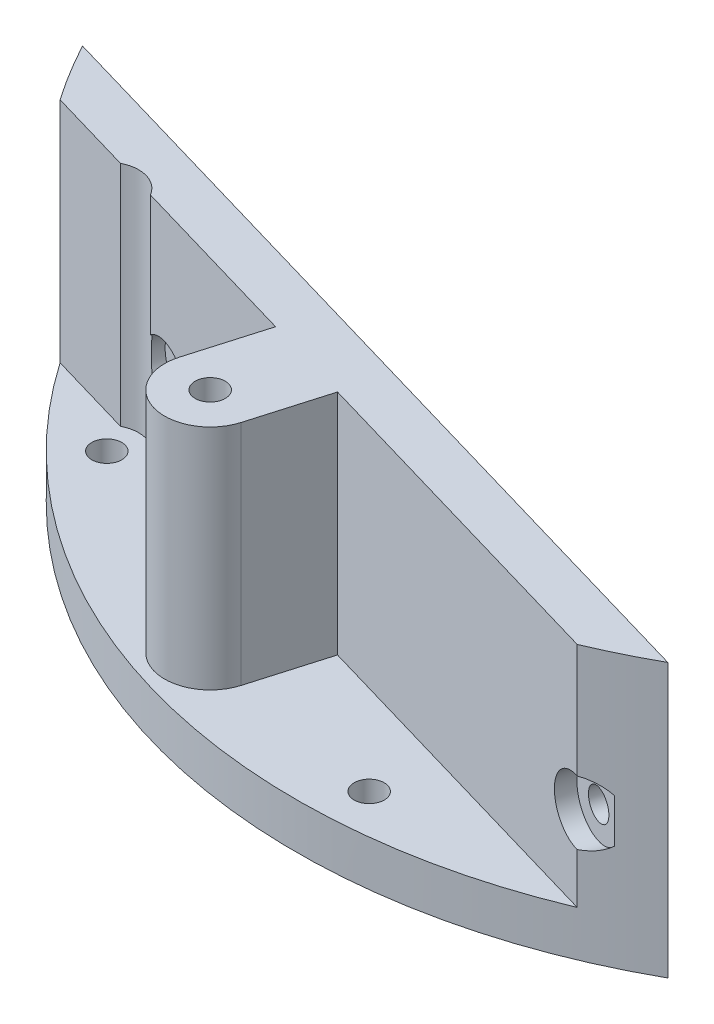
ISO-10303-21;
HEADER;
FILE_DESCRIPTION(('STEP AP214'),'2;1');
FILE_NAME('part.step','',(''),(''),'','','');
FILE_SCHEMA(('AUTOMOTIVE_DESIGN { 1 0 10303 214 1 1 1 1 }'));
ENDSEC;
DATA;
#1=APPLICATION_CONTEXT('core data for automotive mechanical design processes');
#2=APPLICATION_PROTOCOL_DEFINITION('international standard','automotive_design',2000,#1);
#3=PRODUCT_CONTEXT('',#1,'mechanical');
#4=PRODUCT('Part','Part','',(#3));
#5=PRODUCT_RELATED_PRODUCT_CATEGORY('part','',(#4));
#6=PRODUCT_DEFINITION_FORMATION('','',#4);
#7=PRODUCT_DEFINITION_CONTEXT('part definition',#1,'design');
#8=PRODUCT_DEFINITION('design','',#6,#7);
#9=PRODUCT_DEFINITION_SHAPE('','',#8);
#10=(LENGTH_UNIT() NAMED_UNIT(*) SI_UNIT(.MILLI.,.METRE.));
#11=(NAMED_UNIT(*) PLANE_ANGLE_UNIT() SI_UNIT($,.RADIAN.));
#12=(NAMED_UNIT(*) SI_UNIT($,.STERADIAN.) SOLID_ANGLE_UNIT());
#13=UNCERTAINTY_MEASURE_WITH_UNIT(LENGTH_MEASURE(1.E-05),#10,'distance_accuracy_value','');
#14=(GEOMETRIC_REPRESENTATION_CONTEXT(3) GLOBAL_UNCERTAINTY_ASSIGNED_CONTEXT((#13)) GLOBAL_UNIT_ASSIGNED_CONTEXT((#10,
#11,#12)) REPRESENTATION_CONTEXT('',''));
#15=CARTESIAN_POINT('',(0.,0.,0.));
#16=DIRECTION('',(0.,0.,1.));
#17=DIRECTION('',(1.,0.,0.));
#18=AXIS2_PLACEMENT_3D('',#15,#16,#17);
#19=CARTESIAN_POINT('',(-40.4940474039868,30.,41.7677301034971));
#20=DIRECTION('',(0.280164117594872,0.,-0.959952117145583));
#21=DIRECTION('',(-0.959952117145583,0.,-0.280164117594872));
#22=AXIS2_PLACEMENT_3D('',#19,#20,#21);
#23=PLANE('',#22);
#24=DIRECTION('',(0.,-1.,0.));
#25=VECTOR('',#24,1.);
#26=CARTESIAN_POINT('',(-11.4868429994423,30.,50.2335459298721));
#27=LINE('',#26,#25);
#28=CARTESIAN_POINT('',(-11.4868429994422,30.,50.2335459298721));
#29=VERTEX_POINT('',#28);
#30=CARTESIAN_POINT('',(-11.4868429994423,5.,50.2335459298721));
#31=VERTEX_POINT('',#30);
#32=EDGE_CURVE('E65',#29,#31,#27,.T.);
#33=ORIENTED_EDGE('',*,*,#32,.T.);
#34=DIRECTION('',(0.959952117145583,0.,0.280164117594872));
#35=VECTOR('',#34,1.);
#36=CARTESIAN_POINT('',(-40.4940474039868,5.,41.7677301034971));
#37=LINE('',#36,#35);
#38=CARTESIAN_POINT('',(25.6655125353805,5.,61.0765418658934));
#39=VERTEX_POINT('',#38);
#40=EDGE_CURVE('E474',#31,#39,#37,.T.);
#41=ORIENTED_EDGE('',*,*,#40,.T.);
#42=DIRECTION('',(0.,-1.,0.));
#43=VECTOR('',#42,1.);
#44=CARTESIAN_POINT('',(25.6655125353805,30.,61.0765418658934));
#45=LINE('',#44,#43);
#46=CARTESIAN_POINT('',(25.6655125353805,10.5049223900024,61.0765418658934));
#47=VERTEX_POINT('',#46);
#48=EDGE_CURVE('E586',#47,#39,#45,.T.);
#49=ORIENTED_EDGE('',*,*,#48,.F.);
#50=CARTESIAN_POINT('',(25.4873838554586,14.,61.0245546224285));
#51=DIRECTION('',(-0.280164117594872,0.,0.959952117145583));
#52=DIRECTION('',(0.959952117145583,0.,0.280164117594872));
#53=AXIS2_PLACEMENT_3D('',#50,#51,#52);
#54=CIRCLE('',#53,3.5);
#55=CARTESIAN_POINT('',(25.6655125353805,17.4950776099976,61.0765418658934));
#56=VERTEX_POINT('',#55);
#57=EDGE_CURVE('E409',#56,#47,#54,.T.);
#58=ORIENTED_EDGE('',*,*,#57,.F.);
#59=CARTESIAN_POINT('',(25.6655125353805,30.,61.0765418658934));
#60=VERTEX_POINT('',#59);
#61=EDGE_CURVE('E583',#60,#56,#45,.T.);
#62=ORIENTED_EDGE('',*,*,#61,.F.);
#63=DIRECTION('',(0.959952117145583,0.,0.280164117594872));
#64=VECTOR('',#63,1.);
#65=CARTESIAN_POINT('',(-40.4940474039868,30.,41.7677301034971));
#66=LINE('',#65,#64);
#67=EDGE_CURVE('E477',#29,#60,#66,.T.);
#68=ORIENTED_EDGE('',*,*,#67,.F.);
#69=EDGE_LOOP('',(#33,#41,#49,#58,#62,#68));
#70=FACE_BOUND('',#69,.T.);
#71=ADVANCED_FACE('F47',(#70),#23,.F.);
#72=DIRECTION('',(0.,-1.,0.));
#73=VECTOR('',#72,1.);
#74=CARTESIAN_POINT('',(-21.0863641708981,30.,47.4319047539234));
#75=LINE('',#74,#73);
#76=CARTESIAN_POINT('',(-21.0863641708981,30.,47.4319047539234));
#77=VERTEX_POINT('',#76);
#78=CARTESIAN_POINT('',(-21.0863641708981,5.,47.4319047539234));
#79=VERTEX_POINT('',#78);
#80=EDGE_CURVE('E276',#77,#79,#75,.T.);
#81=ORIENTED_EDGE('',*,*,#80,.F.);
#82=CARTESIAN_POINT('',(-40.4940474039868,30.,41.7677301034971));
#83=VERTEX_POINT('',#82);
#84=EDGE_CURVE('E554',#83,#77,#66,.T.);
#85=ORIENTED_EDGE('',*,*,#84,.F.);
#86=DIRECTION('',(0.,-1.,0.));
#87=VECTOR('',#86,1.);
#88=CARTESIAN_POINT('',(-40.4940474039868,30.,41.7677301034971));
#89=LINE('',#88,#87);
#90=CARTESIAN_POINT('',(-40.4940474039868,16.6942272149969,41.7677301034971));
#91=VERTEX_POINT('',#90);
#92=EDGE_CURVE('E495',#83,#91,#89,.T.);
#93=ORIENTED_EDGE('',*,*,#92,.T.);
#94=CARTESIAN_POINT('',(-38.3494319347227,14.,42.3936408023695));
#95=DIRECTION('',(-0.280164117594872,0.,0.959952117145583));
#96=DIRECTION('',(0.959952117145583,0.,0.280164117594872));
#97=AXIS2_PLACEMENT_3D('',#94,#95,#96);
#98=CIRCLE('',#97,3.5);
#99=CARTESIAN_POINT('',(-40.4940474039868,11.3057727850031,41.7677301034971));
#100=VERTEX_POINT('',#99);
#101=EDGE_CURVE('E538',#100,#91,#98,.T.);
#102=ORIENTED_EDGE('',*,*,#101,.F.);
#103=CARTESIAN_POINT('',(-40.4940474039868,5.,41.7677301034971));
#104=VERTEX_POINT('',#103);
#105=EDGE_CURVE('E500',#100,#104,#89,.T.);
#106=ORIENTED_EDGE('',*,*,#105,.T.);
#107=EDGE_CURVE('E483',#104,#79,#37,.T.);
#108=ORIENTED_EDGE('',*,*,#107,.T.);
#109=EDGE_LOOP('',(#81,#85,#93,#102,#106,#108));
#110=FACE_BOUND('',#109,.T.);
#111=ADVANCED_FACE('F348',(#110),#23,.F.);
#112=CARTESIAN_POINT('',(-13.0108216211059,5.,44.5801763202411));
#113=DIRECTION('',(-0.280164117594872,0.,0.959952117145583));
#114=DIRECTION('',(0.959952117145583,0.,0.280164117594872));
#115=AXIS2_PLACEMENT_3D('',#112,#113,#114);
#116=PLANE('',#115);
#117=CARTESIAN_POINT('',(26.888204443433,14.,56.2247940367006));
#118=DIRECTION('',(-0.280164117594872,0.,0.959952117145583));
#119=DIRECTION('',(0.959952117145583,0.,0.280164117594872));
#120=AXIS2_PLACEMENT_3D('',#117,#118,#119);
#121=CIRCLE('',#120,1.64999999999999);
#122=CARTESIAN_POINT('',(28.4721254367232,14.,56.6870648307322));
#123=VERTEX_POINT('',#122);
#124=EDGE_CURVE('E398',#123,#123,#121,.T.);
#125=ORIENTED_EDGE('',*,*,#124,.T.);
#126=EDGE_LOOP('',(#125));
#127=FACE_BOUND('',#126,.T.);
#128=CARTESIAN_POINT('',(-36.9486113467483,14.,37.5938802166416));
#129=DIRECTION('',(-0.280164117594872,0.,0.959952117145583));
#130=DIRECTION('',(0.959952117145583,0.,0.280164117594872));
#131=AXIS2_PLACEMENT_3D('',#128,#129,#130);
#132=CIRCLE('',#131,1.65);
#133=CARTESIAN_POINT('',(-35.3646903534581,14.,38.0561510106732));
#134=VERTEX_POINT('',#133);
#135=EDGE_CURVE('E376',#134,#134,#132,.T.);
#136=ORIENTED_EDGE('',*,*,#135,.T.);
#137=EDGE_LOOP('',(#136));
#138=FACE_BOUND('',#137,.T.);
#139=DIRECTION('',(0.,-1.,0.));
#140=VECTOR('',#139,1.);
#141=CARTESIAN_POINT('',(-58.3667956543592,30.,31.3429364457493));
#142=LINE('',#141,#140);
#143=CARTESIAN_POINT('',(-58.3667956543592,30.,31.3429364457492));
#144=VERTEX_POINT('',#143);
#145=CARTESIAN_POINT('',(-58.3667956543592,0.,31.3429364457493));
#146=VERTEX_POINT('',#145);
#147=EDGE_CURVE('E526',#144,#146,#142,.T.);
#148=ORIENTED_EDGE('',*,*,#147,.F.);
#149=DIRECTION('',(-0.959952117145583,0.,-0.280164117594872));
#150=VECTOR('',#149,1.);
#151=CARTESIAN_POINT('',(-58.7697252563864,30.,31.2253405632166));
#152=LINE('',#151,#150);
#153=CARTESIAN_POINT('',(32.3451524121474,30.,57.8174161947328));
#154=VERTEX_POINT('',#153);
#155=EDGE_CURVE('E557',#154,#144,#152,.T.);
#156=ORIENTED_EDGE('',*,*,#155,.F.);
#157=DIRECTION('',(0.,-1.,0.));
#158=VECTOR('',#157,1.);
#159=CARTESIAN_POINT('',(32.3451524121474,30.,57.8174161947329));
#160=LINE('',#159,#158);
#161=CARTESIAN_POINT('',(32.3451524121474,0.,57.8174161947329));
#162=VERTEX_POINT('',#161);
#163=EDGE_CURVE('E528',#162,#154,#160,.F.);
#164=ORIENTED_EDGE('',*,*,#163,.F.);
#165=DIRECTION('',(-0.959952117145583,0.,-0.280164117594872));
#166=VECTOR('',#165,1.);
#167=CARTESIAN_POINT('',(-13.0108216211059,0.,44.5801763202411));
#168=LINE('',#167,#166);
#169=EDGE_CURVE('E412',#162,#146,#168,.T.);
#170=ORIENTED_EDGE('',*,*,#169,.T.);
#171=EDGE_LOOP('',(#148,#156,#164,#170));
#172=FACE_BOUND('',#171,.T.);
#173=ADVANCED_FACE('F354',(#127,#138,#172),#116,.F.);
#174=CARTESIAN_POINT('',(0.,5.,0.));
#175=DIRECTION('',(0.,1.,0.));
#176=DIRECTION('',(0.,0.,1.));
#177=AXIS2_PLACEMENT_3D('',#174,#175,#176);
#178=PLANE('',#177);
#179=CARTESIAN_POINT('',(-43.522422382032,5.,43.522422382032));
#180=DIRECTION('',(0.,1.,0.));
#181=DIRECTION('',(0.,0.,1.));
#182=AXIS2_PLACEMENT_3D('',#179,#180,#181);
#183=CIRCLE('',#182,1.65);
#184=CARTESIAN_POINT('',(-43.522422382032,5.,45.172422382032));
#185=VERTEX_POINT('',#184);
#186=EDGE_CURVE('E505',#185,#185,#183,.T.);
#187=ORIENTED_EDGE('',*,*,#186,.F.);
#188=EDGE_LOOP('',(#187));
#189=FACE_BOUND('',#188,.T.);
#190=CARTESIAN_POINT('',(3.22127810675323,5.,61.465647864144));
#191=DIRECTION('',(0.,1.,0.));
#192=DIRECTION('',(0.,0.,1.));
#193=AXIS2_PLACEMENT_3D('',#190,#191,#192);
#194=CIRCLE('',#193,1.65);
#195=CARTESIAN_POINT('',(3.22127810675323,5.,63.115647864144));
#196=VERTEX_POINT('',#195);
#197=EDGE_CURVE('E416',#196,#196,#194,.T.);
#198=ORIENTED_EDGE('',*,*,#197,.F.);
#199=EDGE_LOOP('',(#198));
#200=FACE_BOUND('',#199,.T.);
#201=ORIENTED_EDGE('',*,*,#40,.F.);
#202=DIRECTION('',(-0.280164117594872,0.,0.959952117145583));
#203=VECTOR('',#202,1.);
#204=CARTESIAN_POINT('',(2.924799209638,5.,0.853609023903156));
#205=LINE('',#204,#203);
#206=CARTESIAN_POINT('',(-13.8761387861976,5.,58.4202101203932));
#207=VERTEX_POINT('',#206);
#208=EDGE_CURVE('E289',#31,#207,#205,.T.);
#209=ORIENTED_EDGE('',*,*,#208,.T.);
#210=CARTESIAN_POINT('',(-18.6758993719256,5.,57.0193895324188));
#211=DIRECTION('',(0.,1.,0.));
#212=DIRECTION('',(0.,0.,1.));
#213=AXIS2_PLACEMENT_3D('',#210,#211,#212);
#214=CIRCLE('',#213,5.);
#215=CARTESIAN_POINT('',(-23.4756599576535,5.,55.6185689444444));
#216=VERTEX_POINT('',#215);
#217=EDGE_CURVE('E292',#207,#216,#214,.F.);
#218=ORIENTED_EDGE('',*,*,#217,.T.);
#219=DIRECTION('',(0.280164117594872,0.,-0.959952117145583));
#220=VECTOR('',#219,1.);
#221=CARTESIAN_POINT('',(-6.67472196181781,5.,-1.94803215204556));
#222=LINE('',#221,#220);
#223=EDGE_CURVE('E285',#216,#79,#222,.T.);
#224=ORIENTED_EDGE('',*,*,#223,.T.);
#225=ORIENTED_EDGE('',*,*,#107,.F.);
#226=CARTESIAN_POINT('',(-43.522422382032,5.,43.522422382032));
#227=DIRECTION('',(0.,-1.,0.));
#228=DIRECTION('',(0.,0.,1.));
#229=AXIS2_PLACEMENT_3D('',#226,#227,#228);
#230=CIRCLE('',#229,3.5);
#231=CARTESIAN_POINT('',(-45.1315629455846,5.,40.4142610852635));
#232=VERTEX_POINT('',#231);
#233=EDGE_CURVE('E484',#232,#104,#230,.T.);
#234=ORIENTED_EDGE('',*,*,#233,.F.);
#235=DIRECTION('',(0.959952117145583,0.,0.280164117594872));
#236=VECTOR('',#235,1.);
#237=CARTESIAN_POINT('',(-54.9442366709352,5.,37.5504108718968));
#238=LINE('',#237,#236);
#239=CARTESIAN_POINT('',(-54.488796953541,5.,37.6833319460445));
#240=VERTEX_POINT('',#239);
#241=EDGE_CURVE('E491',#240,#232,#238,.T.);
#242=ORIENTED_EDGE('',*,*,#241,.F.);
#243=CARTESIAN_POINT('',(0.,5.,0.));
#244=DIRECTION('',(0.,1.,0.));
#245=DIRECTION('',(0.,0.,1.));
#246=AXIS2_PLACEMENT_3D('',#243,#244,#245);
#247=CIRCLE('',#246,66.25);
#248=EDGE_CURVE('E481',#240,#39,#247,.T.);
#249=ORIENTED_EDGE('',*,*,#248,.T.);
#250=EDGE_LOOP('',(#201,#209,#218,#224,#225,#234,#242,#249));
#251=FACE_BOUND('',#250,.T.);
#252=ADVANCED_FACE('F479',(#189,#200,#251),#178,.T.);
#253=CARTESIAN_POINT('',(0.,0.,0.));
#254=DIRECTION('',(0.,1.,0.));
#255=DIRECTION('',(0.,0.,1.));
#256=AXIS2_PLACEMENT_3D('',#253,#254,#255);
#257=PLANE('',#256);
#258=CARTESIAN_POINT('',(3.22127810675323,0.,61.465647864144));
#259=DIRECTION('',(0.,1.,0.));
#260=DIRECTION('',(0.,0.,1.));
#261=AXIS2_PLACEMENT_3D('',#258,#259,#260);
#262=CIRCLE('',#261,1.65);
#263=CARTESIAN_POINT('',(3.22127810675323,0.,63.115647864144));
#264=VERTEX_POINT('',#263);
#265=EDGE_CURVE('E514',#264,#264,#262,.T.);
#266=ORIENTED_EDGE('',*,*,#265,.T.);
#267=EDGE_LOOP('',(#266));
#268=FACE_BOUND('',#267,.T.);
#269=CARTESIAN_POINT('',(-43.522422382032,0.,43.522422382032));
#270=DIRECTION('',(0.,1.,0.));
#271=DIRECTION('',(0.,0.,1.));
#272=AXIS2_PLACEMENT_3D('',#269,#270,#271);
#273=CIRCLE('',#272,1.65);
#274=CARTESIAN_POINT('',(-43.522422382032,0.,45.172422382032));
#275=VERTEX_POINT('',#274);
#276=EDGE_CURVE('E504',#275,#275,#273,.T.);
#277=ORIENTED_EDGE('',*,*,#276,.T.);
#278=EDGE_LOOP('',(#277));
#279=FACE_BOUND('',#278,.T.);
#280=CARTESIAN_POINT('',(0.,0.,0.));
#281=DIRECTION('',(0.,-1.,0.));
#282=DIRECTION('',(0.,0.,-1.));
#283=AXIS2_PLACEMENT_3D('',#280,#281,#282);
#284=CIRCLE('',#283,66.25);
#285=EDGE_CURVE('E297',#162,#146,#284,.T.);
#286=ORIENTED_EDGE('',*,*,#285,.T.);
#287=ORIENTED_EDGE('',*,*,#169,.F.);
#288=EDGE_LOOP('',(#286,#287));
#289=FACE_BOUND('',#288,.T.);
#290=ADVANCED_FACE('F530',(#268,#279,#289),#257,.F.);
#291=CARTESIAN_POINT('',(-54.9442366709352,30.,37.5504108718968));
#292=DIRECTION('',(0.280164117594872,0.,-0.959952117145583));
#293=DIRECTION('',(-0.959952117145583,0.,-0.280164117594872));
#294=AXIS2_PLACEMENT_3D('',#291,#292,#293);
#295=PLANE('',#294);
#296=DIRECTION('',(0.,-1.,0.));
#297=VECTOR('',#296,1.);
#298=CARTESIAN_POINT('',(-54.488796953541,30.,37.6833319460445));
#299=LINE('',#298,#297);
#300=CARTESIAN_POINT('',(-54.488796953541,30.,37.6833319460445));
#301=VERTEX_POINT('',#300);
#302=EDGE_CURVE('E539',#240,#301,#299,.F.);
#303=ORIENTED_EDGE('',*,*,#302,.F.);
#304=ORIENTED_EDGE('',*,*,#241,.T.);
#305=DIRECTION('',(0.,-1.,0.));
#306=VECTOR('',#305,1.);
#307=CARTESIAN_POINT('',(-45.1315629455846,30.,40.4142610852635));
#308=LINE('',#307,#306);
#309=CARTESIAN_POINT('',(-45.1315629455846,30.,40.4142610852635));
#310=VERTEX_POINT('',#309);
#311=EDGE_CURVE('E499',#310,#232,#308,.T.);
#312=ORIENTED_EDGE('',*,*,#311,.F.);
#313=DIRECTION('',(0.959952117145583,0.,0.280164117594872));
#314=VECTOR('',#313,1.);
#315=CARTESIAN_POINT('',(-54.9442366709352,30.,37.5504108718968));
#316=LINE('',#315,#314);
#317=EDGE_CURVE('E489',#301,#310,#316,.T.);
#318=ORIENTED_EDGE('',*,*,#317,.F.);
#319=EDGE_LOOP('',(#303,#304,#312,#318));
#320=FACE_BOUND('',#319,.T.);
#321=ADVANCED_FACE('F364',(#320),#295,.F.);
#322=CARTESIAN_POINT('',(0.,30.,0.));
#323=DIRECTION('',(0.,1.,0.));
#324=DIRECTION('',(0.,0.,1.));
#325=AXIS2_PLACEMENT_3D('',#322,#323,#324);
#326=PLANE('',#325);
#327=ORIENTED_EDGE('',*,*,#84,.T.);
#328=DIRECTION('',(-0.280164117594872,0.,0.959952117145583));
#329=VECTOR('',#328,1.);
#330=CARTESIAN_POINT('',(-23.4756599576535,30.,55.6185689444444));
#331=LINE('',#330,#329);
#332=CARTESIAN_POINT('',(-23.4756599576535,30.,55.6185689444444));
#333=VERTEX_POINT('',#332);
#334=EDGE_CURVE('E269',#77,#333,#331,.T.);
#335=ORIENTED_EDGE('',*,*,#334,.T.);
#336=CARTESIAN_POINT('',(-18.6758993719256,30.,57.0193895324188));
#337=DIRECTION('',(0.,1.,0.));
#338=DIRECTION('',(0.,0.,1.));
#339=AXIS2_PLACEMENT_3D('',#336,#337,#338);
#340=CIRCLE('',#339,5.);
#341=CARTESIAN_POINT('',(-13.8761387861976,30.,58.4202101203932));
#342=VERTEX_POINT('',#341);
#343=EDGE_CURVE('E262',#333,#342,#340,.T.);
#344=ORIENTED_EDGE('',*,*,#343,.T.);
#345=DIRECTION('',(0.280164117594872,0.,-0.959952117145583));
#346=VECTOR('',#345,1.);
#347=CARTESIAN_POINT('',(-13.8761387861976,30.,58.4202101203932));
#348=LINE('',#347,#346);
#349=EDGE_CURVE('E266',#342,#29,#348,.T.);
#350=ORIENTED_EDGE('',*,*,#349,.T.);
#351=ORIENTED_EDGE('',*,*,#67,.T.);
#352=CARTESIAN_POINT('',(0.,30.,0.));
#353=DIRECTION('',(0.,-1.,0.));
#354=DIRECTION('',(0.,0.,-1.));
#355=AXIS2_PLACEMENT_3D('',#352,#353,#354);
#356=CIRCLE('',#355,66.25);
#357=EDGE_CURVE('E298',#154,#60,#356,.T.);
#358=ORIENTED_EDGE('',*,*,#357,.F.);
#359=ORIENTED_EDGE('',*,*,#155,.T.);
#360=EDGE_CURVE('E302',#301,#144,#356,.T.);
#361=ORIENTED_EDGE('',*,*,#360,.F.);
#362=ORIENTED_EDGE('',*,*,#317,.T.);
#363=CARTESIAN_POINT('',(-43.522422382032,30.,43.522422382032));
#364=DIRECTION('',(0.,-1.,0.));
#365=DIRECTION('',(0.,0.,1.));
#366=AXIS2_PLACEMENT_3D('',#363,#364,#365);
#367=CIRCLE('',#366,3.5);
#368=EDGE_CURVE('E562',#310,#83,#367,.T.);
#369=ORIENTED_EDGE('',*,*,#368,.T.);
#370=EDGE_LOOP('',(#327,#335,#344,#350,#351,#358,#359,#361,#362,#369));
#371=FACE_BOUND('',#370,.T.);
#372=CARTESIAN_POINT('',(-18.6758993719256,30.,57.0193895324188));
#373=DIRECTION('',(0.,1.,0.));
#374=DIRECTION('',(0.,0.,1.));
#375=AXIS2_PLACEMENT_3D('',#372,#373,#374);
#376=CIRCLE('',#375,1.65);
#377=CARTESIAN_POINT('',(-18.6758993719256,30.,58.6693895324188));
#378=VERTEX_POINT('',#377);
#379=EDGE_CURVE('E258',#378,#378,#376,.T.);
#380=ORIENTED_EDGE('',*,*,#379,.F.);
#381=EDGE_LOOP('',(#380));
#382=FACE_BOUND('',#381,.T.);
#383=ADVANCED_FACE('F343',(#371,#382),#326,.T.);
#384=CARTESIAN_POINT('',(26.0477120906484,14.,59.1046503881374));
#385=DIRECTION('',(-0.280164117594872,0.,0.959952117145583));
#386=DIRECTION('',(0.959952117145583,0.,0.280164117594872));
#387=AXIS2_PLACEMENT_3D('',#384,#385,#386);
#388=CYLINDRICAL_SURFACE('',#387,3.5);
#389=CARTESIAN_POINT('',(28.4819093861633,11.5875367921795,59.8150761741418));
#390=CARTESIAN_POINT('',(28.3744268892253,11.4942026766855,59.8662618349527));
#391=CARTESIAN_POINT('',(28.262506606396,11.4071384533856,59.9191933645326));
#392=CARTESIAN_POINT('',(28.0314257366292,11.2454086954693,60.0276414496423));
#393=CARTESIAN_POINT('',(27.9122743839164,11.1707277840021,60.0831546879432));
#394=CARTESIAN_POINT('',(27.6710674427194,11.0350657101046,60.1946159916516));
#395=CARTESIAN_POINT('',(27.5491535256775,10.9737948856385,60.2505204437388));
#396=CARTESIAN_POINT('',(27.3008091038937,10.8624930885034,60.3634571855226));
#397=CARTESIAN_POINT('',(27.1743774901579,10.8124648979266,60.4204897505904));
#398=CARTESIAN_POINT('',(26.8262957689971,10.6917314686765,60.5761513500884));
#399=CARTESIAN_POINT('',(26.6010881612879,10.6317516215983,60.6754173510321));
#400=CARTESIAN_POINT('',(26.2562865248015,10.5656661658201,60.8250457175174));
#401=CARTESIAN_POINT('',(26.1388960893278,10.547558360551,60.8755867348842));
#402=CARTESIAN_POINT('',(25.902961028312,10.519850744111,60.9763525510729));
#403=CARTESIAN_POINT('',(25.7844162439336,10.5102521210011,61.0265773047661));
#404=CARTESIAN_POINT('',(25.6655125353805,10.5049223900024,61.0765418658934));
#405=B_SPLINE_CURVE_WITH_KNOTS('',3,(#389,#390,#391,#392,#393,#394,#395,#396,#397,#398,#399,
#400,#401,#402,#403,#404),.UNSPECIFIED.,.F.,.F.,(4,2,2,2,2,2,2,4),(0.,0.453434704967621,
0.906302075759054,1.34812622917768,1.79005959590942,2.54739956040174,2.93442165449378,
3.32149777651905),.UNSPECIFIED.);
#406=CARTESIAN_POINT('',(28.4819093861633,11.5875367921794,59.8150761741418));
#407=VERTEX_POINT('',#406);
#408=EDGE_CURVE('E314',#407,#47,#405,.T.);
#409=ORIENTED_EDGE('',*,*,#408,.F.);
#410=CARTESIAN_POINT('',(26.0477120906484,14.,59.1046503881374));
#411=DIRECTION('',(-0.280164117594872,0.,0.959952117145583));
#412=DIRECTION('',(0.959952117145583,0.,0.280164117594872));
#413=AXIS2_PLACEMENT_3D('',#410,#411,#412);
#414=CIRCLE('',#413,3.5);
#415=CARTESIAN_POINT('',(28.4819093861633,16.4124632078206,59.8150761741418));
#416=VERTEX_POINT('',#415);
#417=EDGE_CURVE('E402',#416,#407,#414,.T.);
#418=ORIENTED_EDGE('',*,*,#417,.F.);
#419=CARTESIAN_POINT('',(25.6655125353805,17.4950776099976,61.0765418658934));
#420=CARTESIAN_POINT('',(25.8036854333837,17.488885542517,61.0184837103049));
#421=CARTESIAN_POINT('',(25.9414423221483,17.4769183692864,60.9600394700664));
#422=CARTESIAN_POINT('',(26.2153402442106,17.4414883200504,60.8427520917362));
#423=CARTESIAN_POINT('',(26.3514808493499,17.4180224646618,60.7839088541607));
#424=CARTESIAN_POINT('',(26.6179429665665,17.3603768907799,60.6676870670659));
#425=CARTESIAN_POINT('',(26.7483250513793,17.3264774210455,60.6103083980054));
#426=CARTESIAN_POINT('',(27.0059385129889,17.2477618116034,60.4959637296411));
#427=CARTESIAN_POINT('',(27.1331701526938,17.2029465862326,60.4389976961848));
#428=CARTESIAN_POINT('',(27.3673549076727,17.1088273772459,60.3332800977232));
#429=CARTESIAN_POINT('',(27.4747976053172,17.0608597753892,60.284421527747));
#430=CARTESIAN_POINT('',(27.6859472940192,16.9564821476321,60.1877421539485));
#431=CARTESIAN_POINT('',(27.7896555050708,16.900074910438,60.1399210132828));
#432=CARTESIAN_POINT('',(27.9948532019882,16.7773367151002,60.0446811320152));
#433=CARTESIAN_POINT('',(28.0962442428033,16.7108153537007,59.9972941821206));
#434=CARTESIAN_POINT('',(28.2935022933062,16.5685727816028,59.9045260120214));
#435=CARTESIAN_POINT('',(28.3893633885576,16.4928419805805,59.8591469509652));
#436=CARTESIAN_POINT('',(28.4819093861633,16.4124632078206,59.8150761741418));
#437=B_SPLINE_CURVE_WITH_KNOTS('',3,(#419,#420,#421,#422,#423,#424,#425,#426,#427,#428,#429,
#430,#431,#432,#433,#434,#435,#436),.UNSPECIFIED.,.F.,.F.,(4,2,2,2,2,2,2,2,4),(0.,
0.449904980009137,0.899926595009775,1.33878341113055,1.77760347989564,2.15950030584928,
2.54127121928639,2.93140943431199,3.32195745904239),.UNSPECIFIED.);
#438=EDGE_CURVE('E73',#56,#416,#437,.T.);
#439=ORIENTED_EDGE('',*,*,#438,.F.);
#440=ORIENTED_EDGE('',*,*,#57,.T.);
#441=EDGE_LOOP('',(#409,#418,#439,#440));
#442=FACE_BOUND('',#441,.T.);
#443=ADVANCED_FACE('F320',(#442),#388,.F.);
#444=CARTESIAN_POINT('',(26.0477120906484,14.,59.1046503881374));
#445=DIRECTION('',(-0.280164117594872,0.,0.959952117145583));
#446=DIRECTION('',(0.959952117145583,0.,0.280164117594872));
#447=AXIS2_PLACEMENT_3D('',#444,#445,#446);
#448=PLANE('',#447);
#449=CARTESIAN_POINT('',(26.0477120906483,14.,59.1046503881374));
#450=DIRECTION('',(-0.280164117594872,0.,0.959952117145583));
#451=DIRECTION('',(0.959952117145583,0.,0.280164117594872));
#452=AXIS2_PLACEMENT_3D('',#449,#450,#451);
#453=CIRCLE('',#452,1.64999999999999);
#454=CARTESIAN_POINT('',(27.6316330839385,14.,59.5669211821689));
#455=VERTEX_POINT('',#454);
#456=EDGE_CURVE('E400',#455,#455,#453,.F.);
#457=ORIENTED_EDGE('',*,*,#456,.T.);
#458=EDGE_LOOP('',(#457));
#459=FACE_BOUND('',#458,.T.);
#460=ORIENTED_EDGE('',*,*,#417,.T.);
#461=DIRECTION('',(0.,-1.,0.));
#462=VECTOR('',#461,1.);
#463=CARTESIAN_POINT('',(28.4819093861633,30.,59.8150761741418));
#464=LINE('',#463,#462);
#465=EDGE_CURVE('E57',#407,#416,#464,.F.);
#466=ORIENTED_EDGE('',*,*,#465,.T.);
#467=EDGE_LOOP('',(#460,#466));
#468=FACE_BOUND('',#467,.T.);
#469=ADVANCED_FACE('F331',(#459,#468),#448,.T.);
#470=CARTESIAN_POINT('',(-29.7652017695886,14.,12.9807024438554));
#471=DIRECTION('',(-0.280164117594872,0.,0.959952117145583));
#472=DIRECTION('',(0.959952117145583,0.,0.280164117594872));
#473=AXIS2_PLACEMENT_3D('',#470,#471,#472);
#474=CYLINDRICAL_SURFACE('',#473,1.65);
#475=ORIENTED_EDGE('',*,*,#135,.F.);
#476=EDGE_LOOP('',(#475));
#477=FACE_BOUND('',#476,.T.);
#478=CARTESIAN_POINT('',(-37.7891036995329,14.,40.4737365680784));
#479=DIRECTION('',(-0.280164117594872,0.,0.959952117145583));
#480=DIRECTION('',(0.959952117145583,0.,0.280164117594872));
#481=AXIS2_PLACEMENT_3D('',#478,#479,#480);
#482=CIRCLE('',#481,1.65);
#483=CARTESIAN_POINT('',(-36.2051827062427,14.,40.9360073621099));
#484=VERTEX_POINT('',#483);
#485=EDGE_CURVE('E377',#484,#484,#482,.F.);
#486=ORIENTED_EDGE('',*,*,#485,.F.);
#487=EDGE_LOOP('',(#486));
#488=FACE_BOUND('',#487,.T.);
#489=ADVANCED_FACE('F334',(#477,#488),#474,.F.);
#490=CARTESIAN_POINT('',(34.0716140205927,14.,31.6116162639144));
#491=DIRECTION('',(-0.280164117594872,0.,0.959952117145583));
#492=DIRECTION('',(0.959952117145583,0.,0.280164117594872));
#493=AXIS2_PLACEMENT_3D('',#490,#491,#492);
#494=CYLINDRICAL_SURFACE('',#493,1.64999999999999);
#495=ORIENTED_EDGE('',*,*,#124,.F.);
#496=EDGE_LOOP('',(#495));
#497=FACE_BOUND('',#496,.T.);
#498=ORIENTED_EDGE('',*,*,#456,.F.);
#499=EDGE_LOOP('',(#498));
#500=FACE_BOUND('',#499,.T.);
#501=ADVANCED_FACE('F340',(#497,#500),#494,.F.);
#502=CARTESIAN_POINT('',(3.22127810675323,5.,61.465647864144));
#503=DIRECTION('',(0.,-1.,0.));
#504=DIRECTION('',(0.,0.,-1.));
#505=AXIS2_PLACEMENT_3D('',#502,#503,#504);
#506=CYLINDRICAL_SURFACE('',#505,1.65);
#507=ORIENTED_EDGE('',*,*,#197,.T.);
#508=EDGE_LOOP('',(#507));
#509=FACE_BOUND('',#508,.T.);
#510=ORIENTED_EDGE('',*,*,#265,.F.);
#511=EDGE_LOOP('',(#510));
#512=FACE_BOUND('',#511,.T.);
#513=ADVANCED_FACE('F389',(#509,#512),#506,.F.);
#514=CARTESIAN_POINT('',(-43.522422382032,5.,43.522422382032));
#515=DIRECTION('',(0.,-1.,0.));
#516=DIRECTION('',(0.,0.,-1.));
#517=AXIS2_PLACEMENT_3D('',#514,#515,#516);
#518=CYLINDRICAL_SURFACE('',#517,1.65);
#519=ORIENTED_EDGE('',*,*,#186,.T.);
#520=EDGE_LOOP('',(#519));
#521=FACE_BOUND('',#520,.T.);
#522=ORIENTED_EDGE('',*,*,#276,.F.);
#523=EDGE_LOOP('',(#522));
#524=FACE_BOUND('',#523,.T.);
#525=ADVANCED_FACE('F49',(#521,#524),#518,.F.);
#526=CARTESIAN_POINT('',(-43.522422382032,30.,43.522422382032));
#527=DIRECTION('',(0.,-1.,0.));
#528=DIRECTION('',(0.,0.,-1.));
#529=AXIS2_PLACEMENT_3D('',#526,#527,#528);
#530=CYLINDRICAL_SURFACE('',#529,3.5);
#531=ORIENTED_EDGE('',*,*,#105,.F.);
#532=CARTESIAN_POINT('',(-40.4940474039868,11.3057727850031,41.7677301034971));
#533=CARTESIAN_POINT('',(-40.528733153158,11.3472698122374,41.707834674534));
#534=CARTESIAN_POINT('',(-40.5644228373167,11.3914114740109,41.6503647818433));
#535=CARTESIAN_POINT('',(-40.6368706395196,11.4848062526448,41.540532864644));
#536=CARTESIAN_POINT('',(-40.6736282218011,11.5340568371917,41.4881683343199));
#537=CARTESIAN_POINT('',(-40.747098861285,11.637238587066,41.3890271748515));
#538=CARTESIAN_POINT('',(-40.7838109823467,11.6911415334608,41.3422204536373));
#539=CARTESIAN_POINT('',(-40.8565169197601,11.8035644334818,41.253894435175));
#540=CARTESIAN_POINT('',(-40.8925107054618,11.8620845835891,41.212375363135));
#541=CARTESIAN_POINT('',(-40.9629242854401,11.9832949394062,41.1345947533251));
#542=CARTESIAN_POINT('',(-40.9973456953767,12.0459806944402,41.0983277317672));
#543=CARTESIAN_POINT('',(-41.0639442235055,12.1751632982937,41.0308094425514));
#544=CARTESIAN_POINT('',(-41.0961204196848,12.2416616926172,40.9995602287169));
#545=CARTESIAN_POINT('',(-41.15760620704,12.3780178091123,40.9418359956761));
#546=CARTESIAN_POINT('',(-41.1869143767391,12.4478771717475,40.9153633384391));
#547=CARTESIAN_POINT('',(-41.2421367941585,12.590453709022,40.8669298104862));
#548=CARTESIAN_POINT('',(-41.2680497647916,12.6631719457179,40.8449706357378));
#549=CARTESIAN_POINT('',(-41.3418375164841,12.8904852165619,40.7839412882009));
#550=CARTESIAN_POINT('',(-41.3833947197985,13.0491050487259,40.7518362819133));
#551=CARTESIAN_POINT('',(-41.4473174583393,13.372533441148,40.7036358375077));
#552=CARTESIAN_POINT('',(-41.4696752032454,13.5373444852522,40.6875468976042));
#553=CARTESIAN_POINT('',(-41.4884729503259,13.7935890908454,40.6740754383456));
#554=CARTESIAN_POINT('',(-41.4920755985292,13.8843074483971,40.6715132696746));
#555=CARTESIAN_POINT('',(-41.4931881253229,14.0658240086119,40.6707179024348));
#556=CARTESIAN_POINT('',(-41.4906976396424,14.1566222157243,40.6724849626839));
#557=CARTESIAN_POINT('',(-41.4796559357999,14.3376567100492,40.6803898804241));
#558=CARTESIAN_POINT('',(-41.4711045557806,14.4278929821901,40.6865278546413));
#559=CARTESIAN_POINT('',(-41.4480765210406,14.607225078093,40.7033280376179));
#560=CARTESIAN_POINT('',(-41.4335971885924,14.6963203676785,40.7139922910321));
#561=CARTESIAN_POINT('',(-41.3985975164404,14.8745215271084,40.7403623618448));
#562=CARTESIAN_POINT('',(-41.3779581944374,14.9635893463897,40.7561680864969));
#563=CARTESIAN_POINT('',(-41.3311567504874,15.1390919695341,40.7930923649513));
#564=CARTESIAN_POINT('',(-41.3049973021322,15.2255280249461,40.8142083477544));
#565=CARTESIAN_POINT('',(-41.2476724171537,15.3951136545372,40.8621763593635));
#566=CARTESIAN_POINT('',(-41.2165059313232,15.47826253534,40.88902959078));
#567=CARTESIAN_POINT('',(-41.1498656279885,15.6405128408197,40.9489074081836));
#568=CARTESIAN_POINT('',(-41.1143923128764,15.7196147360508,40.9819312746071));
#569=CARTESIAN_POINT('',(-41.0419367213816,15.8690715124932,41.0526818178968));
#570=CARTESIAN_POINT('',(-41.0051275134704,15.9396672096944,41.0900767157421));
#571=CARTESIAN_POINT('',(-40.9293243950186,16.0759600103113,41.171057681927));
#572=CARTESIAN_POINT('',(-40.8903308330473,16.1416578914201,41.2146427641599));
#573=CARTESIAN_POINT('',(-40.8112823320116,16.2674902813125,41.3080480769854));
#574=CARTESIAN_POINT('',(-40.7712299336329,16.3276367839048,41.3578542910943));
#575=CARTESIAN_POINT('',(-40.6911379567276,16.4420817801291,41.4637272831988));
#576=CARTESIAN_POINT('',(-40.6510983894337,16.4963844143551,41.5197895703999));
#577=CARTESIAN_POINT('',(-40.5916400293928,16.573654736734,41.6088350006215));
#578=CARTESIAN_POINT('',(-40.5717761389077,16.598884871111,41.6395884368734));
#579=CARTESIAN_POINT('',(-40.5325245521553,16.647746240621,41.7025632376023));
#580=CARTESIAN_POINT('',(-40.5131363530121,16.6713792150707,41.7347829391438));
#581=CARTESIAN_POINT('',(-40.4940474039868,16.6942272149969,41.7677301034971));
#582=B_SPLINE_CURVE_WITH_KNOTS('',3,(#532,#533,#534,#535,#536,#537,#538,#539,#540,#541,#542,
#543,#544,#545,#546,#547,#548,#549,#550,#551,#552,#553,#554,#555,#556,#557,#558,#559,#560,#561,
#562,#563,#564,#565,#566,#567,#568,#569,#570,#571,#572,#573,#574,#575,#576,#577,#578,#579,#580,
#581),.UNSPECIFIED.,.F.,.F.,(4,2,2,2,2,2,2,2,2,2,2,2,2,2,2,2,2,2,2,2,2,2,2,2,4),(0.,
0.242005617280049,0.483891848917671,0.724402122377119,0.964922636070504,1.2051901774807,
1.44555581275285,1.68603998312047,1.92661435229393,2.42566958998046,2.92492722741674,
3.19714032972389,3.46936970636777,3.74160635322504,4.0139661085732,4.2919706033586,
4.56984075855641,4.84776921660421,5.12566528535184,5.38918130700169,5.65265539709766,
5.91554622851178,6.17824954849138,6.31158842719843,6.44477967786702),.UNSPECIFIED.);
#583=EDGE_CURVE('E367',#100,#91,#582,.T.);
#584=ORIENTED_EDGE('',*,*,#583,.T.);
#585=ORIENTED_EDGE('',*,*,#92,.F.);
#586=ORIENTED_EDGE('',*,*,#368,.F.);
#587=ORIENTED_EDGE('',*,*,#311,.T.);
#588=ORIENTED_EDGE('',*,*,#233,.T.);
#589=EDGE_LOOP('',(#531,#584,#585,#586,#587,#588));
#590=FACE_BOUND('',#589,.T.);
#591=ADVANCED_FACE('F358',(#590),#530,.F.);
#592=CARTESIAN_POINT('',(-37.789103699533,14.,40.4737365680784));
#593=DIRECTION('',(-0.280164117594872,0.,0.959952117145583));
#594=DIRECTION('',(0.959952117145583,0.,0.280164117594872));
#595=AXIS2_PLACEMENT_3D('',#592,#593,#594);
#596=CYLINDRICAL_SURFACE('',#595,3.5);
#597=CARTESIAN_POINT('',(-37.789103699533,14.,40.4737365680784));
#598=DIRECTION('',(-0.280164117594872,0.,0.959952117145583));
#599=DIRECTION('',(0.959952117145583,0.,0.280164117594872));
#600=AXIS2_PLACEMENT_3D('',#597,#598,#599);
#601=CIRCLE('',#600,3.5);
#602=CARTESIAN_POINT('',(-34.4292712895234,14.,41.4543109796604));
#603=VERTEX_POINT('',#602);
#604=EDGE_CURVE('E378',#603,#603,#601,.T.);
#605=ORIENTED_EDGE('',*,*,#604,.F.);
#606=EDGE_LOOP('',(#605));
#607=FACE_BOUND('',#606,.T.);
#608=ORIENTED_EDGE('',*,*,#101,.T.);
#609=ORIENTED_EDGE('',*,*,#583,.F.);
#610=EDGE_LOOP('',(#608,#609));
#611=FACE_BOUND('',#610,.T.);
#612=ADVANCED_FACE('F362',(#607,#611),#596,.F.);
#613=CARTESIAN_POINT('',(-37.789103699533,14.,40.4737365680784));
#614=DIRECTION('',(-0.280164117594872,0.,0.959952117145583));
#615=DIRECTION('',(0.959952117145583,0.,0.280164117594872));
#616=AXIS2_PLACEMENT_3D('',#613,#614,#615);
#617=PLANE('',#616);
#618=ORIENTED_EDGE('',*,*,#604,.T.);
#619=EDGE_LOOP('',(#618));
#620=FACE_BOUND('',#619,.T.);
#621=ORIENTED_EDGE('',*,*,#485,.T.);
#622=EDGE_LOOP('',(#621));
#623=FACE_BOUND('',#622,.T.);
#624=ADVANCED_FACE('F329',(#620,#623),#617,.T.);
#625=CARTESIAN_POINT('',(0.,30.,0.));
#626=DIRECTION('',(0.,-1.,0.));
#627=DIRECTION('',(0.,0.,-1.));
#628=AXIS2_PLACEMENT_3D('',#625,#626,#627);
#629=CYLINDRICAL_SURFACE('',#628,66.25);
#630=ORIENTED_EDGE('',*,*,#147,.T.);
#631=ORIENTED_EDGE('',*,*,#285,.F.);
#632=ORIENTED_EDGE('',*,*,#163,.T.);
#633=ORIENTED_EDGE('',*,*,#357,.T.);
#634=ORIENTED_EDGE('',*,*,#61,.T.);
#635=ORIENTED_EDGE('',*,*,#438,.T.);
#636=ORIENTED_EDGE('',*,*,#465,.F.);
#637=ORIENTED_EDGE('',*,*,#408,.T.);
#638=ORIENTED_EDGE('',*,*,#48,.T.);
#639=ORIENTED_EDGE('',*,*,#248,.F.);
#640=ORIENTED_EDGE('',*,*,#302,.T.);
#641=ORIENTED_EDGE('',*,*,#360,.T.);
#642=EDGE_LOOP('',(#630,#631,#632,#633,#634,#635,#636,#637,#638,#639,#640,#641));
#643=FACE_BOUND('',#642,.T.);
#644=ADVANCED_FACE('F324',(#643),#629,.T.);
#645=CARTESIAN_POINT('',(-18.6758993719256,30.,57.0193895324188));
#646=DIRECTION('',(0.,-1.,0.));
#647=DIRECTION('',(0.,0.,-1.));
#648=AXIS2_PLACEMENT_3D('',#645,#646,#647);
#649=CYLINDRICAL_SURFACE('',#648,5.);
#650=ORIENTED_EDGE('',*,*,#217,.F.);
#651=DIRECTION('',(0.,-1.,0.));
#652=VECTOR('',#651,1.);
#653=CARTESIAN_POINT('',(-13.8761387861976,30.,58.4202101203932));
#654=LINE('',#653,#652);
#655=EDGE_CURVE('E281',#342,#207,#654,.T.);
#656=ORIENTED_EDGE('',*,*,#655,.F.);
#657=ORIENTED_EDGE('',*,*,#343,.F.);
#658=DIRECTION('',(0.,-1.,0.));
#659=VECTOR('',#658,1.);
#660=CARTESIAN_POINT('',(-23.4756599576535,30.,55.6185689444444));
#661=LINE('',#660,#659);
#662=EDGE_CURVE('E272',#333,#216,#661,.T.);
#663=ORIENTED_EDGE('',*,*,#662,.T.);
#664=EDGE_LOOP('',(#650,#656,#657,#663));
#665=FACE_BOUND('',#664,.T.);
#666=ADVANCED_FACE('F328',(#665),#649,.T.);
#667=CARTESIAN_POINT('',(-13.8761387861976,30.,58.4202101203932));
#668=DIRECTION('',(-0.959952117145583,0.,-0.280164117594872));
#669=DIRECTION('',(-0.280164117594872,0.,0.959952117145583));
#670=AXIS2_PLACEMENT_3D('',#667,#668,#669);
#671=PLANE('',#670);
#672=ORIENTED_EDGE('',*,*,#208,.F.);
#673=ORIENTED_EDGE('',*,*,#32,.F.);
#674=ORIENTED_EDGE('',*,*,#349,.F.);
#675=ORIENTED_EDGE('',*,*,#655,.T.);
#676=EDGE_LOOP('',(#672,#673,#674,#675));
#677=FACE_BOUND('',#676,.T.);
#678=ADVANCED_FACE('F462',(#677),#671,.F.);
#679=CARTESIAN_POINT('',(-23.4756599576535,30.,55.6185689444444));
#680=DIRECTION('',(0.959952117145583,0.,0.280164117594872));
#681=DIRECTION('',(0.280164117594872,0.,-0.959952117145583));
#682=AXIS2_PLACEMENT_3D('',#679,#680,#681);
#683=PLANE('',#682);
#684=ORIENTED_EDGE('',*,*,#223,.F.);
#685=ORIENTED_EDGE('',*,*,#662,.F.);
#686=ORIENTED_EDGE('',*,*,#334,.F.);
#687=ORIENTED_EDGE('',*,*,#80,.T.);
#688=EDGE_LOOP('',(#684,#685,#686,#687));
#689=FACE_BOUND('',#688,.T.);
#690=ADVANCED_FACE('F459',(#689),#683,.F.);
#691=CARTESIAN_POINT('',(-18.6758993719256,30.,57.0193895324188));
#692=DIRECTION('',(0.,-1.,0.));
#693=DIRECTION('',(0.,0.,-1.));
#694=AXIS2_PLACEMENT_3D('',#691,#692,#693);
#695=CYLINDRICAL_SURFACE('',#694,1.65);
#696=CARTESIAN_POINT('',(-18.6758993719256,27.,57.0193895324188));
#697=DIRECTION('',(0.,1.,0.));
#698=DIRECTION('',(0.,0.,1.));
#699=AXIS2_PLACEMENT_3D('',#696,#697,#698);
#700=CIRCLE('',#699,1.65);
#701=CARTESIAN_POINT('',(-18.6758993719256,27.,58.6693895324188));
#702=VERTEX_POINT('',#701);
#703=EDGE_CURVE('E246',#702,#702,#700,.T.);
#704=ORIENTED_EDGE('',*,*,#703,.F.);
#705=EDGE_LOOP('',(#704));
#706=FACE_BOUND('',#705,.T.);
#707=ORIENTED_EDGE('',*,*,#379,.T.);
#708=EDGE_LOOP('',(#707));
#709=FACE_BOUND('',#708,.T.);
#710=ADVANCED_FACE('F456',(#706,#709),#695,.F.);
#711=CARTESIAN_POINT('',(-16.6969148818845,24.4,59.5027247336171));
#712=DIRECTION('',(0.930746928256613,0.,0.365663992677539));
#713=DIRECTION('',(0.365663992677539,0.,-0.930746928256613));
#714=AXIS2_PLACEMENT_3D('',#711,#712,#713);
#715=PLANE('',#714);
#716=DIRECTION('',(0.365663992677539,0.,-0.930746928256613));
#717=VECTOR('',#716,1.);
#718=CARTESIAN_POINT('',(-16.6969148818845,27.,59.5027247336171));
#719=LINE('',#718,#717);
#720=CARTESIAN_POINT('',(-16.6969148818845,27.,59.5027247336171));
#721=VERTEX_POINT('',#720);
#722=CARTESIAN_POINT('',(-15.5357757565552,27.,56.547206290947));
#723=VERTEX_POINT('',#722);
#724=EDGE_CURVE('E188',#721,#723,#719,.T.);
#725=ORIENTED_EDGE('',*,*,#724,.T.);
#726=DIRECTION('',(0.,1.,0.));
#727=VECTOR('',#726,1.);
#728=CARTESIAN_POINT('',(-15.5357757565552,24.4,56.547206290947));
#729=LINE('',#728,#727);
#730=CARTESIAN_POINT('',(-15.5357757565552,24.4,56.547206290947));
#731=VERTEX_POINT('',#730);
#732=EDGE_CURVE('E181',#731,#723,#729,.T.);
#733=ORIENTED_EDGE('',*,*,#732,.F.);
#734=DIRECTION('',(0.365663992677539,0.,-0.930746928256613));
#735=VECTOR('',#734,1.);
#736=CARTESIAN_POINT('',(-16.6969148818845,24.4,59.5027247336171));
#737=LINE('',#736,#735);
#738=CARTESIAN_POINT('',(-16.6969148818845,24.4,59.5027247336171));
#739=VERTEX_POINT('',#738);
#740=EDGE_CURVE('E185',#739,#731,#737,.T.);
#741=ORIENTED_EDGE('',*,*,#740,.F.);
#742=DIRECTION('',(0.,1.,0.));
#743=VECTOR('',#742,1.);
#744=CARTESIAN_POINT('',(-16.6969148818845,24.4,59.5027247336171));
#745=LINE('',#744,#743);
#746=EDGE_CURVE('E243',#739,#721,#745,.T.);
#747=ORIENTED_EDGE('',*,*,#746,.T.);
#748=EDGE_LOOP('',(#725,#733,#741,#747));
#749=FACE_BOUND('',#748,.T.);
#750=ADVANCED_FACE('F183',(#749),#715,.F.);
#751=CARTESIAN_POINT('',(-19.8370384972549,24.4,59.9749079750888));
#752=DIRECTION('',(0.148699157220312,0.,0.988882480703329));
#753=DIRECTION('',(0.988882480703329,0.,-0.148699157220312));
#754=AXIS2_PLACEMENT_3D('',#751,#752,#753);
#755=PLANE('',#754);
#756=DIRECTION('',(0.988882480703329,0.,-0.148699157220312));
#757=VECTOR('',#756,1.);
#758=CARTESIAN_POINT('',(-19.8370384972549,27.,59.9749079750888));
#759=LINE('',#758,#757);
#760=CARTESIAN_POINT('',(-19.8370384972549,27.,59.9749079750888));
#761=VERTEX_POINT('',#760);
#762=EDGE_CURVE('E209',#761,#721,#759,.T.);
#763=ORIENTED_EDGE('',*,*,#762,.T.);
#764=ORIENTED_EDGE('',*,*,#746,.F.);
#765=DIRECTION('',(0.988882480703329,0.,-0.148699157220312));
#766=VECTOR('',#765,1.);
#767=CARTESIAN_POINT('',(-19.8370384972549,24.4,59.9749079750888));
#768=LINE('',#767,#766);
#769=CARTESIAN_POINT('',(-19.8370384972549,24.4,59.9749079750888));
#770=VERTEX_POINT('',#769);
#771=EDGE_CURVE('E194',#770,#739,#768,.T.);
#772=ORIENTED_EDGE('',*,*,#771,.F.);
#773=DIRECTION('',(0.,1.,0.));
#774=VECTOR('',#773,1.);
#775=CARTESIAN_POINT('',(-19.8370384972549,24.4,59.9749079750888));
#776=LINE('',#775,#774);
#777=EDGE_CURVE('E247',#770,#761,#776,.T.);
#778=ORIENTED_EDGE('',*,*,#777,.T.);
#779=EDGE_LOOP('',(#763,#764,#772,#778));
#780=FACE_BOUND('',#779,.T.);
#781=ADVANCED_FACE('F439',(#780),#755,.F.);
#782=CARTESIAN_POINT('',(-21.8160229872959,24.4,57.4915727738906));
#783=DIRECTION('',(-0.782047771036302,0.,0.62321848802579));
#784=DIRECTION('',(0.62321848802579,0.,0.782047771036302));
#785=AXIS2_PLACEMENT_3D('',#782,#783,#784);
#786=PLANE('',#785);
#787=DIRECTION('',(0.62321848802579,0.,0.782047771036302));
#788=VECTOR('',#787,1.);
#789=CARTESIAN_POINT('',(-21.8160229872959,27.,57.4915727738906));
#790=LINE('',#789,#788);
#791=CARTESIAN_POINT('',(-21.8160229872959,27.,57.4915727738906));
#792=VERTEX_POINT('',#791);
#793=EDGE_CURVE('E213',#792,#761,#790,.T.);
#794=ORIENTED_EDGE('',*,*,#793,.T.);
#795=ORIENTED_EDGE('',*,*,#777,.F.);
#796=DIRECTION('',(0.62321848802579,0.,0.782047771036302));
#797=VECTOR('',#796,1.);
#798=CARTESIAN_POINT('',(-21.8160229872959,24.4,57.4915727738906));
#799=LINE('',#798,#797);
#800=CARTESIAN_POINT('',(-21.8160229872959,24.4,57.4915727738906));
#801=VERTEX_POINT('',#800);
#802=EDGE_CURVE('E222',#801,#770,#799,.T.);
#803=ORIENTED_EDGE('',*,*,#802,.F.);
#804=DIRECTION('',(0.,1.,0.));
#805=VECTOR('',#804,1.);
#806=CARTESIAN_POINT('',(-21.8160229872959,24.4,57.4915727738906));
#807=LINE('',#806,#805);
#808=EDGE_CURVE('E250',#801,#792,#807,.T.);
#809=ORIENTED_EDGE('',*,*,#808,.T.);
#810=EDGE_LOOP('',(#794,#795,#803,#809));
#811=FACE_BOUND('',#810,.T.);
#812=ADVANCED_FACE('F442',(#811),#786,.F.);
#813=CARTESIAN_POINT('',(-20.6548838619666,24.4,54.5360543312205));
#814=DIRECTION('',(-0.930746928256614,0.,-0.365663992677537));
#815=DIRECTION('',(-0.365663992677537,0.,0.930746928256614));
#816=AXIS2_PLACEMENT_3D('',#813,#814,#815);
#817=PLANE('',#816);
#818=DIRECTION('',(-0.365663992677537,0.,0.930746928256614));
#819=VECTOR('',#818,1.);
#820=CARTESIAN_POINT('',(-20.6548838619666,27.,54.5360543312205));
#821=LINE('',#820,#819);
#822=CARTESIAN_POINT('',(-20.6548838619666,27.,54.5360543312205));
#823=VERTEX_POINT('',#822);
#824=EDGE_CURVE('E236',#823,#792,#821,.T.);
#825=ORIENTED_EDGE('',*,*,#824,.T.);
#826=ORIENTED_EDGE('',*,*,#808,.F.);
#827=DIRECTION('',(-0.365663992677537,0.,0.930746928256614));
#828=VECTOR('',#827,1.);
#829=CARTESIAN_POINT('',(-20.6548838619666,24.4,54.5360543312205));
#830=LINE('',#829,#828);
#831=CARTESIAN_POINT('',(-20.6548838619666,24.4,54.5360543312205));
#832=VERTEX_POINT('',#831);
#833=EDGE_CURVE('E218',#832,#801,#830,.T.);
#834=ORIENTED_EDGE('',*,*,#833,.F.);
#835=DIRECTION('',(0.,1.,0.));
#836=VECTOR('',#835,1.);
#837=CARTESIAN_POINT('',(-20.6548838619666,24.4,54.5360543312205));
#838=LINE('',#837,#836);
#839=EDGE_CURVE('E253',#832,#823,#838,.T.);
#840=ORIENTED_EDGE('',*,*,#839,.T.);
#841=EDGE_LOOP('',(#825,#826,#834,#840));
#842=FACE_BOUND('',#841,.T.);
#843=ADVANCED_FACE('F446',(#842),#817,.F.);
#844=CARTESIAN_POINT('',(-17.5147602465962,24.4,54.0638710897487));
#845=DIRECTION('',(-0.148699157220311,0.,-0.988882480703329));
#846=DIRECTION('',(-0.988882480703329,0.,0.148699157220311));
#847=AXIS2_PLACEMENT_3D('',#844,#845,#846);
#848=PLANE('',#847);
#849=DIRECTION('',(-0.988882480703329,0.,0.148699157220311));
#850=VECTOR('',#849,1.);
#851=CARTESIAN_POINT('',(-17.5147602465962,27.,54.0638710897487));
#852=LINE('',#851,#850);
#853=CARTESIAN_POINT('',(-17.5147602465962,27.,54.0638710897487));
#854=VERTEX_POINT('',#853);
#855=EDGE_CURVE('E232',#854,#823,#852,.T.);
#856=ORIENTED_EDGE('',*,*,#855,.T.);
#857=ORIENTED_EDGE('',*,*,#839,.F.);
#858=DIRECTION('',(-0.988882480703329,0.,0.148699157220311));
#859=VECTOR('',#858,1.);
#860=CARTESIAN_POINT('',(-17.5147602465962,24.4,54.0638710897487));
#861=LINE('',#860,#859);
#862=CARTESIAN_POINT('',(-17.5147602465962,24.4,54.0638710897487));
#863=VERTEX_POINT('',#862);
#864=EDGE_CURVE('E203',#863,#832,#861,.T.);
#865=ORIENTED_EDGE('',*,*,#864,.F.);
#866=DIRECTION('',(0.,1.,0.));
#867=VECTOR('',#866,1.);
#868=CARTESIAN_POINT('',(-17.5147602465962,24.4,54.0638710897487));
#869=LINE('',#868,#867);
#870=EDGE_CURVE('E193',#863,#854,#869,.T.);
#871=ORIENTED_EDGE('',*,*,#870,.T.);
#872=EDGE_LOOP('',(#856,#857,#865,#871));
#873=FACE_BOUND('',#872,.T.);
#874=ADVANCED_FACE('F436',(#873),#848,.F.);
#875=CARTESIAN_POINT('',(-15.5357757565552,24.4,56.547206290947));
#876=DIRECTION('',(0.782047771036303,0.,-0.623218488025789));
#877=DIRECTION('',(-0.623218488025789,0.,-0.782047771036303));
#878=AXIS2_PLACEMENT_3D('',#875,#876,#877);
#879=PLANE('',#878);
#880=DIRECTION('',(-0.623218488025789,0.,-0.782047771036303));
#881=VECTOR('',#880,1.);
#882=CARTESIAN_POINT('',(-15.5357757565552,27.,56.547206290947));
#883=LINE('',#882,#881);
#884=EDGE_CURVE('E229',#723,#854,#883,.T.);
#885=ORIENTED_EDGE('',*,*,#884,.T.);
#886=ORIENTED_EDGE('',*,*,#870,.F.);
#887=DIRECTION('',(-0.623218488025789,0.,-0.782047771036303));
#888=VECTOR('',#887,1.);
#889=CARTESIAN_POINT('',(-15.5357757565552,24.4,56.547206290947));
#890=LINE('',#889,#888);
#891=EDGE_CURVE('E197',#731,#863,#890,.T.);
#892=ORIENTED_EDGE('',*,*,#891,.F.);
#893=ORIENTED_EDGE('',*,*,#732,.T.);
#894=EDGE_LOOP('',(#885,#886,#892,#893));
#895=FACE_BOUND('',#894,.T.);
#896=ADVANCED_FACE('F198',(#895),#879,.F.);
#897=CARTESIAN_POINT('',(0.,24.4,0.));
#898=DIRECTION('',(0.,1.,0.));
#899=DIRECTION('',(0.,0.,1.));
#900=AXIS2_PLACEMENT_3D('',#897,#898,#899);
#901=PLANE('',#900);
#902=CARTESIAN_POINT('',(-18.6758993719256,24.4,57.0193895324188));
#903=DIRECTION('',(0.,1.,0.));
#904=DIRECTION('',(0.,0.,1.));
#905=AXIS2_PLACEMENT_3D('',#902,#903,#904);
#906=CIRCLE('',#905,1.65);
#907=CARTESIAN_POINT('',(-18.6758993719256,24.4,58.6693895324188));
#908=VERTEX_POINT('',#907);
#909=EDGE_CURVE('E51',#908,#908,#906,.T.);
#910=ORIENTED_EDGE('',*,*,#909,.F.);
#911=EDGE_LOOP('',(#910));
#912=FACE_BOUND('',#911,.T.);
#913=ORIENTED_EDGE('',*,*,#740,.T.);
#914=ORIENTED_EDGE('',*,*,#891,.T.);
#915=ORIENTED_EDGE('',*,*,#864,.T.);
#916=ORIENTED_EDGE('',*,*,#833,.T.);
#917=ORIENTED_EDGE('',*,*,#802,.T.);
#918=ORIENTED_EDGE('',*,*,#771,.T.);
#919=EDGE_LOOP('',(#913,#914,#915,#916,#917,#918));
#920=FACE_BOUND('',#919,.T.);
#921=ADVANCED_FACE('F205',(#912,#920),#901,.T.);
#922=CARTESIAN_POINT('',(0.,27.,0.));
#923=DIRECTION('',(0.,1.,0.));
#924=DIRECTION('',(0.,0.,1.));
#925=AXIS2_PLACEMENT_3D('',#922,#923,#924);
#926=PLANE('',#925);
#927=ORIENTED_EDGE('',*,*,#703,.T.);
#928=EDGE_LOOP('',(#927));
#929=FACE_BOUND('',#928,.T.);
#930=ORIENTED_EDGE('',*,*,#724,.F.);
#931=ORIENTED_EDGE('',*,*,#762,.F.);
#932=ORIENTED_EDGE('',*,*,#793,.F.);
#933=ORIENTED_EDGE('',*,*,#824,.F.);
#934=ORIENTED_EDGE('',*,*,#855,.F.);
#935=ORIENTED_EDGE('',*,*,#884,.F.);
#936=EDGE_LOOP('',(#930,#931,#932,#933,#934,#935));
#937=FACE_BOUND('',#936,.T.);
#938=ADVANCED_FACE('F428',(#929,#937),#926,.F.);
#939=CARTESIAN_POINT('',(-18.6758993719256,5.,57.0193895324188));
#940=DIRECTION('',(0.,1.,0.));
#941=DIRECTION('',(0.,0.,1.));
#942=AXIS2_PLACEMENT_3D('',#939,#940,#941);
#943=CIRCLE('',#942,1.65);
#944=CARTESIAN_POINT('',(-18.6758993719256,5.,58.6693895324188));
#945=VERTEX_POINT('',#944);
#946=EDGE_CURVE('E11',#945,#945,#943,.F.);
#947=ORIENTED_EDGE('',*,*,#946,.F.);
#948=EDGE_LOOP('',(#947));
#949=FACE_BOUND('',#948,.T.);
#950=ADVANCED_FACE('F434',(#949),#178,.T.);
#951=ORIENTED_EDGE('',*,*,#946,.T.);
#952=EDGE_LOOP('',(#951));
#953=FACE_BOUND('',#952,.T.);
#954=ORIENTED_EDGE('',*,*,#909,.T.);
#955=EDGE_LOOP('',(#954));
#956=FACE_BOUND('',#955,.T.);
#957=ADVANCED_FACE('F425',(#953,#956),#695,.F.);
#958=CLOSED_SHELL('',(#71,#111,#173,#252,#290,#321,#383,#443,#469,#489,#501,#513,#525,#591,#612,
#624,#644,#666,#678,#690,#710,#750,#781,#812,#843,#874,#896,#921,#938,#950,#957));
#959=MANIFOLD_SOLID_BREP('B2',#958);
#960=ADVANCED_BREP_SHAPE_REPRESENTATION('',(#18,#959),#14);
#961=SHAPE_DEFINITION_REPRESENTATION(#9,#960);
ENDSEC;
END-ISO-10303-21;
